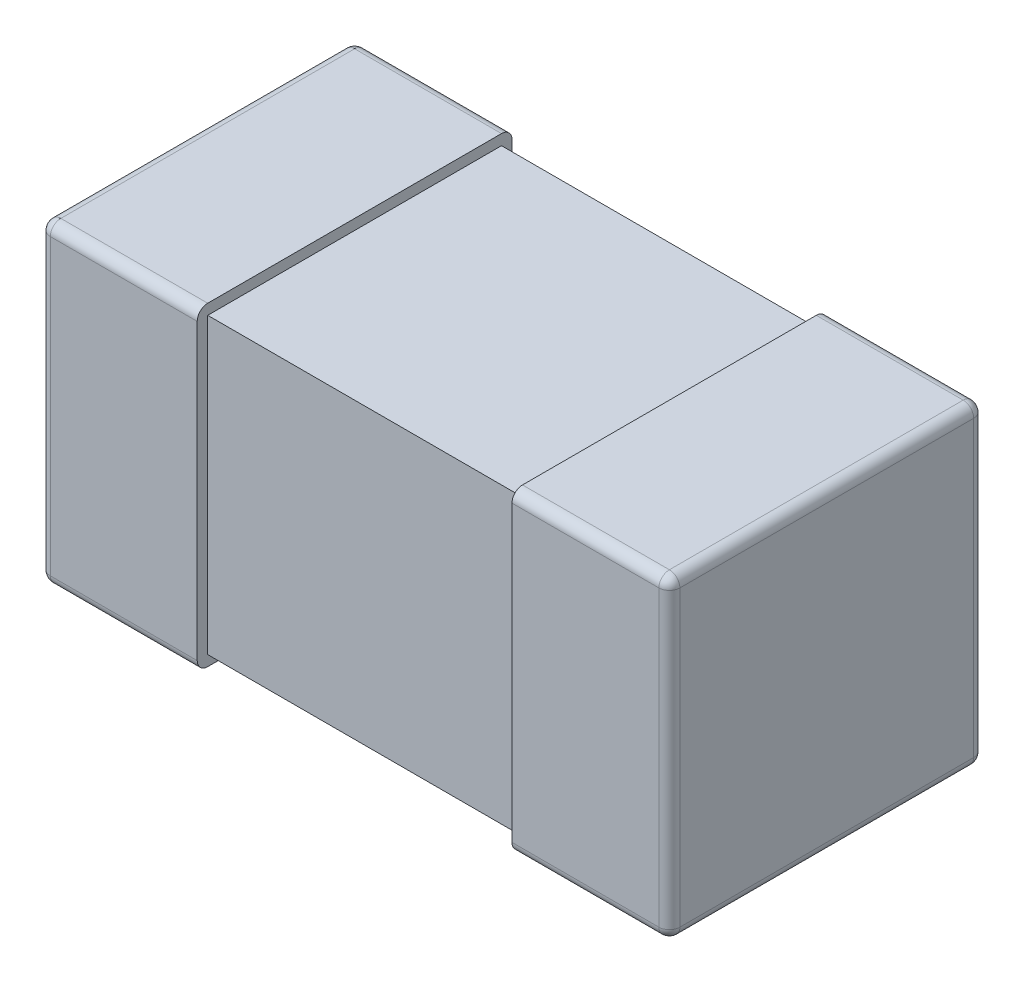
ISO-10303-21;
HEADER;
FILE_DESCRIPTION(('STEP AP214'),'2;1');
FILE_NAME('part.step','',(''),(''),'','','');
FILE_SCHEMA(('AUTOMOTIVE_DESIGN { 1 0 10303 214 1 1 1 1 }'));
ENDSEC;
DATA;
#1=APPLICATION_CONTEXT('core data for automotive mechanical design processes');
#2=APPLICATION_PROTOCOL_DEFINITION('international standard','automotive_design',2000,#1);
#3=PRODUCT_CONTEXT('',#1,'mechanical');
#4=PRODUCT('Part','Part','',(#3));
#5=PRODUCT_RELATED_PRODUCT_CATEGORY('part','',(#4));
#6=PRODUCT_DEFINITION_FORMATION('','',#4);
#7=PRODUCT_DEFINITION_CONTEXT('part definition',#1,'design');
#8=PRODUCT_DEFINITION('design','',#6,#7);
#9=PRODUCT_DEFINITION_SHAPE('','',#8);
#10=(LENGTH_UNIT() NAMED_UNIT(*) SI_UNIT(.MILLI.,.METRE.));
#11=(NAMED_UNIT(*) PLANE_ANGLE_UNIT() SI_UNIT($,.RADIAN.));
#12=(NAMED_UNIT(*) SI_UNIT($,.STERADIAN.) SOLID_ANGLE_UNIT());
#13=UNCERTAINTY_MEASURE_WITH_UNIT(LENGTH_MEASURE(1.E-05),#10,'distance_accuracy_value','');
#14=(GEOMETRIC_REPRESENTATION_CONTEXT(3) GLOBAL_UNCERTAINTY_ASSIGNED_CONTEXT((#13)) GLOBAL_UNIT_ASSIGNED_CONTEXT((#10,
#11,#12)) REPRESENTATION_CONTEXT('',''));
#15=CARTESIAN_POINT('',(0.,0.,0.));
#16=DIRECTION('',(0.,0.,1.));
#17=DIRECTION('',(1.,0.,0.));
#18=AXIS2_PLACEMENT_3D('',#15,#16,#17);
#19=CARTESIAN_POINT('',(-0.3,0.15,-0.15));
#20=DIRECTION('',(1.,0.,0.));
#21=DIRECTION('',(0.,1.,0.));
#22=AXIS2_PLACEMENT_3D('',#19,#20,#21);
#23=PLANE('',#22);
#24=DIRECTION('',(0.,-1.,0.));
#25=VECTOR('',#24,1.);
#26=CARTESIAN_POINT('',(-0.3,0.15,-0.14));
#27=LINE('',#26,#25);
#28=CARTESIAN_POINT('',(-0.3,0.14,-0.14));
#29=VERTEX_POINT('',#28);
#30=CARTESIAN_POINT('',(-0.3,-0.14,-0.14));
#31=VERTEX_POINT('',#30);
#32=EDGE_CURVE('E11',#29,#31,#27,.T.);
#33=ORIENTED_EDGE('',*,*,#32,.T.);
#34=DIRECTION('',(0.,0.,1.));
#35=VECTOR('',#34,1.);
#36=CARTESIAN_POINT('',(-0.3,-0.14,-0.15));
#37=LINE('',#36,#35);
#38=CARTESIAN_POINT('',(-0.3,-0.14,0.14));
#39=VERTEX_POINT('',#38);
#40=EDGE_CURVE('E29',#31,#39,#37,.T.);
#41=ORIENTED_EDGE('',*,*,#40,.T.);
#42=DIRECTION('',(0.,1.,0.));
#43=VECTOR('',#42,1.);
#44=CARTESIAN_POINT('',(-0.3,0.15,0.14));
#45=LINE('',#44,#43);
#46=CARTESIAN_POINT('',(-0.3,0.14,0.14));
#47=VERTEX_POINT('',#46);
#48=EDGE_CURVE('E253',#39,#47,#45,.T.);
#49=ORIENTED_EDGE('',*,*,#48,.T.);
#50=DIRECTION('',(0.,0.,-1.));
#51=VECTOR('',#50,1.);
#52=CARTESIAN_POINT('',(-0.3,0.14,-0.15));
#53=LINE('',#52,#51);
#54=EDGE_CURVE('E246',#47,#29,#53,.T.);
#55=ORIENTED_EDGE('',*,*,#54,.T.);
#56=EDGE_LOOP('',(#33,#41,#49,#55));
#57=FACE_BOUND('',#56,.T.);
#58=ADVANCED_FACE('F18',(#57),#23,.F.);
#59=CARTESIAN_POINT('',(-0.3,0.15,0.15));
#60=DIRECTION('',(0.,0.,-1.));
#61=DIRECTION('',(0.,-1.,0.));
#62=AXIS2_PLACEMENT_3D('',#59,#60,#61);
#63=PLANE('',#62);
#64=DIRECTION('',(0.,-1.,0.));
#65=VECTOR('',#64,1.);
#66=CARTESIAN_POINT('',(-0.29,0.15,0.15));
#67=LINE('',#66,#65);
#68=CARTESIAN_POINT('',(-0.29,0.14,0.15));
#69=VERTEX_POINT('',#68);
#70=CARTESIAN_POINT('',(-0.29,-0.14,0.15));
#71=VERTEX_POINT('',#70);
#72=EDGE_CURVE('E254',#69,#71,#67,.T.);
#73=ORIENTED_EDGE('',*,*,#72,.T.);
#74=DIRECTION('',(1.,0.,0.));
#75=VECTOR('',#74,1.);
#76=CARTESIAN_POINT('',(-0.3,-0.14,0.15));
#77=LINE('',#76,#75);
#78=CARTESIAN_POINT('',(-0.15,-0.14,0.15));
#79=VERTEX_POINT('',#78);
#80=EDGE_CURVE('E317',#71,#79,#77,.T.);
#81=ORIENTED_EDGE('',*,*,#80,.T.);
#82=DIRECTION('',(0.,-1.,0.));
#83=VECTOR('',#82,1.);
#84=CARTESIAN_POINT('',(-0.15,0.15,0.15));
#85=LINE('',#84,#83);
#86=CARTESIAN_POINT('',(-0.15,0.14,0.15));
#87=VERTEX_POINT('',#86);
#88=EDGE_CURVE('E308',#87,#79,#85,.T.);
#89=ORIENTED_EDGE('',*,*,#88,.F.);
#90=DIRECTION('',(-1.,0.,0.));
#91=VECTOR('',#90,1.);
#92=CARTESIAN_POINT('',(-0.3,0.14,0.15));
#93=LINE('',#92,#91);
#94=EDGE_CURVE('E321',#87,#69,#93,.T.);
#95=ORIENTED_EDGE('',*,*,#94,.T.);
#96=EDGE_LOOP('',(#73,#81,#89,#95));
#97=FACE_BOUND('',#96,.T.);
#98=ADVANCED_FACE('F922',(#97),#63,.F.);
#99=CARTESIAN_POINT('',(-0.15,0.15,-0.15));
#100=DIRECTION('',(-1.,0.,0.));
#101=DIRECTION('',(0.,0.,1.));
#102=AXIS2_PLACEMENT_3D('',#99,#100,#101);
#103=PLANE('',#102);
#104=DIRECTION('',(0.,0.,-1.));
#105=VECTOR('',#104,1.);
#106=CARTESIAN_POINT('',(-0.15,-0.15,-0.15));
#107=LINE('',#106,#105);
#108=CARTESIAN_POINT('',(-0.15,-0.15,0.14));
#109=VERTEX_POINT('',#108);
#110=CARTESIAN_POINT('',(-0.15,-0.15,-0.14));
#111=VERTEX_POINT('',#110);
#112=EDGE_CURVE('E363',#109,#111,#107,.T.);
#113=ORIENTED_EDGE('',*,*,#112,.T.);
#114=CARTESIAN_POINT('',(-0.15,-0.14,-0.14));
#115=DIRECTION('',(1.,0.,0.));
#116=DIRECTION('',(0.,0.,1.));
#117=AXIS2_PLACEMENT_3D('',#114,#115,#116);
#118=CIRCLE('',#117,0.01);
#119=CARTESIAN_POINT('',(-0.15,-0.14,-0.15));
#120=VERTEX_POINT('',#119);
#121=EDGE_CURVE('E399',#111,#120,#118,.T.);
#122=ORIENTED_EDGE('',*,*,#121,.T.);
#123=DIRECTION('',(0.,-1.,0.));
#124=VECTOR('',#123,1.);
#125=CARTESIAN_POINT('',(-0.15,0.15,-0.15));
#126=LINE('',#125,#124);
#127=CARTESIAN_POINT('',(-0.15,0.14,-0.15));
#128=VERTEX_POINT('',#127);
#129=EDGE_CURVE('E22',#128,#120,#126,.T.);
#130=ORIENTED_EDGE('',*,*,#129,.F.);
#131=CARTESIAN_POINT('',(-0.15,0.14,-0.14));
#132=DIRECTION('',(1.,0.,0.));
#133=DIRECTION('',(0.,0.,1.));
#134=AXIS2_PLACEMENT_3D('',#131,#132,#133);
#135=CIRCLE('',#134,0.01);
#136=CARTESIAN_POINT('',(-0.15,0.15,-0.14));
#137=VERTEX_POINT('',#136);
#138=EDGE_CURVE('E451',#128,#137,#135,.T.);
#139=ORIENTED_EDGE('',*,*,#138,.T.);
#140=DIRECTION('',(0.,0.,-1.));
#141=VECTOR('',#140,1.);
#142=CARTESIAN_POINT('',(-0.15,0.15,-0.15));
#143=LINE('',#142,#141);
#144=CARTESIAN_POINT('',(-0.15,0.15,0.14));
#145=VERTEX_POINT('',#144);
#146=EDGE_CURVE('E115',#145,#137,#143,.T.);
#147=ORIENTED_EDGE('',*,*,#146,.F.);
#148=CARTESIAN_POINT('',(-0.15,0.14,0.14));
#149=DIRECTION('',(1.,0.,0.));
#150=DIRECTION('',(0.,0.,1.));
#151=AXIS2_PLACEMENT_3D('',#148,#149,#150);
#152=CIRCLE('',#151,0.01);
#153=EDGE_CURVE('E471',#145,#87,#152,.T.);
#154=ORIENTED_EDGE('',*,*,#153,.T.);
#155=ORIENTED_EDGE('',*,*,#88,.T.);
#156=CARTESIAN_POINT('',(-0.15,-0.14,0.14));
#157=DIRECTION('',(1.,0.,0.));
#158=DIRECTION('',(0.,0.,1.));
#159=AXIS2_PLACEMENT_3D('',#156,#157,#158);
#160=CIRCLE('',#159,0.01);
#161=EDGE_CURVE('E127',#79,#109,#160,.T.);
#162=ORIENTED_EDGE('',*,*,#161,.T.);
#163=EDGE_LOOP('',(#113,#122,#130,#139,#147,#154,#155,#162));
#164=FACE_BOUND('',#163,.T.);
#165=DIRECTION('',(0.,1.,0.));
#166=VECTOR('',#165,1.);
#167=CARTESIAN_POINT('',(-0.15,0.14,-0.14));
#168=LINE('',#167,#166);
#169=CARTESIAN_POINT('',(-0.15,-0.14,-0.14));
#170=VERTEX_POINT('',#169);
#171=CARTESIAN_POINT('',(-0.15,0.14,-0.14));
#172=VERTEX_POINT('',#171);
#173=EDGE_CURVE('E456',#170,#172,#168,.T.);
#174=ORIENTED_EDGE('',*,*,#173,.F.);
#175=DIRECTION('',(0.,0.,-1.));
#176=VECTOR('',#175,1.);
#177=CARTESIAN_POINT('',(-0.15,-0.14,0.14));
#178=LINE('',#177,#176);
#179=CARTESIAN_POINT('',(-0.15,-0.14,0.14));
#180=VERTEX_POINT('',#179);
#181=EDGE_CURVE('E432',#180,#170,#178,.T.);
#182=ORIENTED_EDGE('',*,*,#181,.F.);
#183=DIRECTION('',(0.,-1.,0.));
#184=VECTOR('',#183,1.);
#185=CARTESIAN_POINT('',(-0.15,0.14,0.14));
#186=LINE('',#185,#184);
#187=CARTESIAN_POINT('',(-0.15,0.14,0.14));
#188=VERTEX_POINT('',#187);
#189=EDGE_CURVE('E375',#188,#180,#186,.T.);
#190=ORIENTED_EDGE('',*,*,#189,.F.);
#191=DIRECTION('',(0.,0.,1.));
#192=VECTOR('',#191,1.);
#193=CARTESIAN_POINT('',(-0.15,0.14,0.14));
#194=LINE('',#193,#192);
#195=EDGE_CURVE('E457',#172,#188,#194,.T.);
#196=ORIENTED_EDGE('',*,*,#195,.F.);
#197=EDGE_LOOP('',(#174,#182,#190,#196));
#198=FACE_BOUND('',#197,.T.);
#199=ADVANCED_FACE('F916',(#164,#198),#103,.F.);
#200=CARTESIAN_POINT('',(-0.3,0.15,-0.15));
#201=DIRECTION('',(0.,0.,1.));
#202=DIRECTION('',(1.,0.,0.));
#203=AXIS2_PLACEMENT_3D('',#200,#201,#202);
#204=PLANE('',#203);
#205=ORIENTED_EDGE('',*,*,#129,.T.);
#206=DIRECTION('',(-1.,0.,0.));
#207=VECTOR('',#206,1.);
#208=CARTESIAN_POINT('',(-0.3,-0.14,-0.15));
#209=LINE('',#208,#207);
#210=CARTESIAN_POINT('',(-0.29,-0.14,-0.15));
#211=VERTEX_POINT('',#210);
#212=EDGE_CURVE('E346',#120,#211,#209,.T.);
#213=ORIENTED_EDGE('',*,*,#212,.T.);
#214=DIRECTION('',(0.,1.,0.));
#215=VECTOR('',#214,1.);
#216=CARTESIAN_POINT('',(-0.29,0.15,-0.15));
#217=LINE('',#216,#215);
#218=CARTESIAN_POINT('',(-0.29,0.14,-0.15));
#219=VERTEX_POINT('',#218);
#220=EDGE_CURVE('E350',#211,#219,#217,.T.);
#221=ORIENTED_EDGE('',*,*,#220,.T.);
#222=DIRECTION('',(1.,0.,0.));
#223=VECTOR('',#222,1.);
#224=CARTESIAN_POINT('',(-0.15,0.14,-0.15));
#225=LINE('',#224,#223);
#226=EDGE_CURVE('E373',#219,#128,#225,.T.);
#227=ORIENTED_EDGE('',*,*,#226,.T.);
#228=EDGE_LOOP('',(#205,#213,#221,#227));
#229=FACE_BOUND('',#228,.T.);
#230=ADVANCED_FACE('F921',(#229),#204,.F.);
#231=CARTESIAN_POINT('',(-0.3,0.15,0.15));
#232=DIRECTION('',(0.,1.,0.));
#233=DIRECTION('',(1.,0.,0.));
#234=AXIS2_PLACEMENT_3D('',#231,#232,#233);
#235=PLANE('',#234);
#236=ORIENTED_EDGE('',*,*,#146,.T.);
#237=DIRECTION('',(-1.,0.,0.));
#238=VECTOR('',#237,1.);
#239=CARTESIAN_POINT('',(-0.3,0.15,-0.14));
#240=LINE('',#239,#238);
#241=CARTESIAN_POINT('',(-0.29,0.15,-0.14));
#242=VERTEX_POINT('',#241);
#243=EDGE_CURVE('E374',#137,#242,#240,.T.);
#244=ORIENTED_EDGE('',*,*,#243,.T.);
#245=DIRECTION('',(0.,0.,1.));
#246=VECTOR('',#245,1.);
#247=CARTESIAN_POINT('',(-0.29,0.15,0.15));
#248=LINE('',#247,#246);
#249=CARTESIAN_POINT('',(-0.29,0.15,0.14));
#250=VERTEX_POINT('',#249);
#251=EDGE_CURVE('E337',#242,#250,#248,.T.);
#252=ORIENTED_EDGE('',*,*,#251,.T.);
#253=DIRECTION('',(1.,0.,0.));
#254=VECTOR('',#253,1.);
#255=CARTESIAN_POINT('',(-0.15,0.15,0.14));
#256=LINE('',#255,#254);
#257=EDGE_CURVE('E333',#250,#145,#256,.T.);
#258=ORIENTED_EDGE('',*,*,#257,.T.);
#259=EDGE_LOOP('',(#236,#244,#252,#258));
#260=FACE_BOUND('',#259,.T.);
#261=ADVANCED_FACE('F1003',(#260),#235,.T.);
#262=CARTESIAN_POINT('',(-0.3,-0.15,0.15));
#263=DIRECTION('',(0.,1.,0.));
#264=DIRECTION('',(1.,0.,0.));
#265=AXIS2_PLACEMENT_3D('',#262,#263,#264);
#266=PLANE('',#265);
#267=DIRECTION('',(0.,0.,-1.));
#268=VECTOR('',#267,1.);
#269=CARTESIAN_POINT('',(-0.29,-0.15,0.15));
#270=LINE('',#269,#268);
#271=CARTESIAN_POINT('',(-0.29,-0.15,0.14));
#272=VERTEX_POINT('',#271);
#273=CARTESIAN_POINT('',(-0.29,-0.15,-0.14));
#274=VERTEX_POINT('',#273);
#275=EDGE_CURVE('E338',#272,#274,#270,.T.);
#276=ORIENTED_EDGE('',*,*,#275,.T.);
#277=DIRECTION('',(1.,0.,0.));
#278=VECTOR('',#277,1.);
#279=CARTESIAN_POINT('',(-0.3,-0.15,-0.14));
#280=LINE('',#279,#278);
#281=EDGE_CURVE('E447',#274,#111,#280,.T.);
#282=ORIENTED_EDGE('',*,*,#281,.T.);
#283=ORIENTED_EDGE('',*,*,#112,.F.);
#284=DIRECTION('',(-1.,0.,0.));
#285=VECTOR('',#284,1.);
#286=CARTESIAN_POINT('',(-0.3,-0.15,0.14));
#287=LINE('',#286,#285);
#288=EDGE_CURVE('E385',#109,#272,#287,.T.);
#289=ORIENTED_EDGE('',*,*,#288,.T.);
#290=EDGE_LOOP('',(#276,#282,#283,#289));
#291=FACE_BOUND('',#290,.T.);
#292=ADVANCED_FACE('F998',(#291),#266,.F.);
#293=CARTESIAN_POINT('',(-0.3,0.14,-0.14));
#294=DIRECTION('',(1.,0.,0.));
#295=DIRECTION('',(0.,0.,-1.));
#296=AXIS2_PLACEMENT_3D('',#293,#294,#295);
#297=CYLINDRICAL_SURFACE('',#296,0.01);
#298=ORIENTED_EDGE('',*,*,#138,.F.);
#299=ORIENTED_EDGE('',*,*,#226,.F.);
#300=CARTESIAN_POINT('',(-0.29,0.14,-0.14));
#301=DIRECTION('',(-1.,0.,0.));
#302=DIRECTION('',(0.,0.,1.));
#303=AXIS2_PLACEMENT_3D('',#300,#301,#302);
#304=CIRCLE('',#303,0.01);
#305=EDGE_CURVE('E386',#242,#219,#304,.T.);
#306=ORIENTED_EDGE('',*,*,#305,.F.);
#307=ORIENTED_EDGE('',*,*,#243,.F.);
#308=EDGE_LOOP('',(#298,#299,#306,#307));
#309=FACE_BOUND('',#308,.T.);
#310=ADVANCED_FACE('F20',(#309),#297,.T.);
#311=CARTESIAN_POINT('',(-0.29,0.14,0.15));
#312=DIRECTION('',(0.,0.,-1.));
#313=DIRECTION('',(-1.,0.,0.));
#314=AXIS2_PLACEMENT_3D('',#311,#312,#313);
#315=CYLINDRICAL_SURFACE('',#314,0.01);
#316=CARTESIAN_POINT('',(-0.29,0.14,0.14));
#317=DIRECTION('',(0.,0.,1.));
#318=DIRECTION('',(1.,0.,0.));
#319=AXIS2_PLACEMENT_3D('',#316,#317,#318);
#320=CIRCLE('',#319,0.01);
#321=EDGE_CURVE('E232',#250,#47,#320,.T.);
#322=ORIENTED_EDGE('',*,*,#321,.F.);
#323=ORIENTED_EDGE('',*,*,#251,.F.);
#324=CARTESIAN_POINT('',(-0.29,0.14,-0.14));
#325=DIRECTION('',(0.,0.,-1.));
#326=DIRECTION('',(0.,1.,0.));
#327=AXIS2_PLACEMENT_3D('',#324,#325,#326);
#328=CIRCLE('',#327,0.01);
#329=EDGE_CURVE('E250',#29,#242,#328,.T.);
#330=ORIENTED_EDGE('',*,*,#329,.F.);
#331=ORIENTED_EDGE('',*,*,#54,.F.);
#332=EDGE_LOOP('',(#322,#323,#330,#331));
#333=FACE_BOUND('',#332,.T.);
#334=ADVANCED_FACE('F248',(#333),#315,.T.);
#335=CARTESIAN_POINT('',(-0.3,0.14,0.14));
#336=DIRECTION('',(-1.,0.,0.));
#337=DIRECTION('',(0.,0.,1.));
#338=AXIS2_PLACEMENT_3D('',#335,#336,#337);
#339=CYLINDRICAL_SURFACE('',#338,0.01);
#340=ORIENTED_EDGE('',*,*,#153,.F.);
#341=ORIENTED_EDGE('',*,*,#257,.F.);
#342=CARTESIAN_POINT('',(-0.29,0.14,0.14));
#343=DIRECTION('',(-1.,0.,0.));
#344=DIRECTION('',(0.,0.,1.));
#345=AXIS2_PLACEMENT_3D('',#342,#343,#344);
#346=CIRCLE('',#345,0.01);
#347=EDGE_CURVE('E238',#69,#250,#346,.T.);
#348=ORIENTED_EDGE('',*,*,#347,.F.);
#349=ORIENTED_EDGE('',*,*,#94,.F.);
#350=EDGE_LOOP('',(#340,#341,#348,#349));
#351=FACE_BOUND('',#350,.T.);
#352=ADVANCED_FACE('F1053',(#351),#339,.T.);
#353=CARTESIAN_POINT('',(-0.29,0.14,-0.14));
#354=DIRECTION('',(0.,1.,0.));
#355=DIRECTION('',(1.,0.,0.));
#356=AXIS2_PLACEMENT_3D('',#353,#354,#355);
#357=SPHERICAL_SURFACE('',#356,0.01);
#358=ORIENTED_EDGE('',*,*,#329,.T.);
#359=ORIENTED_EDGE('',*,*,#305,.T.);
#360=CARTESIAN_POINT('',(-0.29,0.14,-0.14));
#361=DIRECTION('',(0.,-1.,0.));
#362=DIRECTION('',(0.,0.,1.));
#363=AXIS2_PLACEMENT_3D('',#360,#361,#362);
#364=CIRCLE('',#363,0.01);
#365=EDGE_CURVE('E243',#29,#219,#364,.T.);
#366=ORIENTED_EDGE('',*,*,#365,.F.);
#367=EDGE_LOOP('',(#358,#359,#366));
#368=FACE_BOUND('',#367,.T.);
#369=ADVANCED_FACE('F852',(#368),#357,.T.);
#370=CARTESIAN_POINT('',(-0.29,0.14,0.14));
#371=DIRECTION('',(0.,1.,0.));
#372=DIRECTION('',(1.,0.,0.));
#373=AXIS2_PLACEMENT_3D('',#370,#371,#372);
#374=SPHERICAL_SURFACE('',#373,0.01);
#375=ORIENTED_EDGE('',*,*,#347,.T.);
#376=ORIENTED_EDGE('',*,*,#321,.T.);
#377=CARTESIAN_POINT('',(-0.29,0.14,0.14));
#378=DIRECTION('',(0.,-1.,0.));
#379=DIRECTION('',(0.,0.,1.));
#380=AXIS2_PLACEMENT_3D('',#377,#378,#379);
#381=CIRCLE('',#380,0.01);
#382=EDGE_CURVE('E236',#69,#47,#381,.T.);
#383=ORIENTED_EDGE('',*,*,#382,.F.);
#384=EDGE_LOOP('',(#375,#376,#383));
#385=FACE_BOUND('',#384,.T.);
#386=ADVANCED_FACE('F234',(#385),#374,.T.);
#387=CARTESIAN_POINT('',(-0.3,-0.14,-0.14));
#388=DIRECTION('',(-1.,0.,0.));
#389=DIRECTION('',(0.,0.,1.));
#390=AXIS2_PLACEMENT_3D('',#387,#388,#389);
#391=CYLINDRICAL_SURFACE('',#390,0.01);
#392=ORIENTED_EDGE('',*,*,#121,.F.);
#393=ORIENTED_EDGE('',*,*,#281,.F.);
#394=CARTESIAN_POINT('',(-0.29,-0.14,-0.14));
#395=DIRECTION('',(-1.,0.,0.));
#396=DIRECTION('',(0.,0.,1.));
#397=AXIS2_PLACEMENT_3D('',#394,#395,#396);
#398=CIRCLE('',#397,0.01);
#399=EDGE_CURVE('E274',#211,#274,#398,.T.);
#400=ORIENTED_EDGE('',*,*,#399,.F.);
#401=ORIENTED_EDGE('',*,*,#212,.F.);
#402=EDGE_LOOP('',(#392,#393,#400,#401));
#403=FACE_BOUND('',#402,.T.);
#404=ADVANCED_FACE('F851',(#403),#391,.T.);
#405=CARTESIAN_POINT('',(-0.29,0.15,-0.14));
#406=DIRECTION('',(0.,-1.,0.));
#407=DIRECTION('',(0.,0.,-1.));
#408=AXIS2_PLACEMENT_3D('',#405,#406,#407);
#409=CYLINDRICAL_SURFACE('',#408,0.01);
#410=ORIENTED_EDGE('',*,*,#365,.T.);
#411=ORIENTED_EDGE('',*,*,#220,.F.);
#412=CARTESIAN_POINT('',(-0.29,-0.14,-0.14));
#413=DIRECTION('',(0.,-1.,0.));
#414=DIRECTION('',(0.,0.,-1.));
#415=AXIS2_PLACEMENT_3D('',#412,#413,#414);
#416=CIRCLE('',#415,0.01);
#417=EDGE_CURVE('E44',#31,#211,#416,.T.);
#418=ORIENTED_EDGE('',*,*,#417,.F.);
#419=ORIENTED_EDGE('',*,*,#32,.F.);
#420=EDGE_LOOP('',(#410,#411,#418,#419));
#421=FACE_BOUND('',#420,.T.);
#422=ADVANCED_FACE('F864',(#421),#409,.T.);
#423=CARTESIAN_POINT('',(-0.29,0.15,0.14));
#424=DIRECTION('',(0.,-1.,0.));
#425=DIRECTION('',(0.,0.,-1.));
#426=AXIS2_PLACEMENT_3D('',#423,#424,#425);
#427=CYLINDRICAL_SURFACE('',#426,0.01);
#428=ORIENTED_EDGE('',*,*,#382,.T.);
#429=ORIENTED_EDGE('',*,*,#48,.F.);
#430=CARTESIAN_POINT('',(-0.29,-0.14,0.14));
#431=DIRECTION('',(0.,-1.,0.));
#432=DIRECTION('',(0.,0.,-1.));
#433=AXIS2_PLACEMENT_3D('',#430,#431,#432);
#434=CIRCLE('',#433,0.01);
#435=EDGE_CURVE('E436',#71,#39,#434,.T.);
#436=ORIENTED_EDGE('',*,*,#435,.F.);
#437=ORIENTED_EDGE('',*,*,#72,.F.);
#438=EDGE_LOOP('',(#428,#429,#436,#437));
#439=FACE_BOUND('',#438,.T.);
#440=ADVANCED_FACE('F263',(#439),#427,.T.);
#441=CARTESIAN_POINT('',(-0.3,-0.14,0.14));
#442=DIRECTION('',(1.,0.,0.));
#443=DIRECTION('',(0.,0.,-1.));
#444=AXIS2_PLACEMENT_3D('',#441,#442,#443);
#445=CYLINDRICAL_SURFACE('',#444,0.01);
#446=ORIENTED_EDGE('',*,*,#161,.F.);
#447=ORIENTED_EDGE('',*,*,#80,.F.);
#448=CARTESIAN_POINT('',(-0.29,-0.14,0.14));
#449=DIRECTION('',(-1.,0.,0.));
#450=DIRECTION('',(0.,0.,1.));
#451=AXIS2_PLACEMENT_3D('',#448,#449,#450);
#452=CIRCLE('',#451,0.01);
#453=EDGE_CURVE('E311',#272,#71,#452,.T.);
#454=ORIENTED_EDGE('',*,*,#453,.F.);
#455=ORIENTED_EDGE('',*,*,#288,.F.);
#456=EDGE_LOOP('',(#446,#447,#454,#455));
#457=FACE_BOUND('',#456,.T.);
#458=ADVANCED_FACE('F894',(#457),#445,.T.);
#459=CARTESIAN_POINT('',(-0.29,-0.14,-0.14));
#460=DIRECTION('',(0.,1.,0.));
#461=DIRECTION('',(1.,0.,0.));
#462=AXIS2_PLACEMENT_3D('',#459,#460,#461);
#463=SPHERICAL_SURFACE('',#462,0.01);
#464=ORIENTED_EDGE('',*,*,#417,.T.);
#465=ORIENTED_EDGE('',*,*,#399,.T.);
#466=CARTESIAN_POINT('',(-0.29,-0.14,-0.14));
#467=DIRECTION('',(0.,0.,1.));
#468=DIRECTION('',(-1.,0.,0.));
#469=AXIS2_PLACEMENT_3D('',#466,#467,#468);
#470=CIRCLE('',#469,0.01);
#471=EDGE_CURVE('E431',#31,#274,#470,.T.);
#472=ORIENTED_EDGE('',*,*,#471,.F.);
#473=EDGE_LOOP('',(#464,#465,#472));
#474=FACE_BOUND('',#473,.T.);
#475=ADVANCED_FACE('F888',(#474),#463,.T.);
#476=CARTESIAN_POINT('',(-0.29,-0.14,0.14));
#477=DIRECTION('',(0.,1.,0.));
#478=DIRECTION('',(1.,0.,0.));
#479=AXIS2_PLACEMENT_3D('',#476,#477,#478);
#480=SPHERICAL_SURFACE('',#479,0.01);
#481=ORIENTED_EDGE('',*,*,#453,.T.);
#482=ORIENTED_EDGE('',*,*,#435,.T.);
#483=CARTESIAN_POINT('',(-0.29,-0.14,0.14));
#484=DIRECTION('',(0.,0.,-1.));
#485=DIRECTION('',(1.,0.,0.));
#486=AXIS2_PLACEMENT_3D('',#483,#484,#485);
#487=CIRCLE('',#486,0.01);
#488=EDGE_CURVE('E428',#272,#39,#487,.T.);
#489=ORIENTED_EDGE('',*,*,#488,.F.);
#490=EDGE_LOOP('',(#481,#482,#489));
#491=FACE_BOUND('',#490,.T.);
#492=ADVANCED_FACE('F893',(#491),#480,.T.);
#493=CARTESIAN_POINT('',(-0.29,-0.14,-0.15));
#494=DIRECTION('',(0.,0.,1.));
#495=DIRECTION('',(1.,0.,0.));
#496=AXIS2_PLACEMENT_3D('',#493,#494,#495);
#497=CYLINDRICAL_SURFACE('',#496,0.01);
#498=ORIENTED_EDGE('',*,*,#471,.T.);
#499=ORIENTED_EDGE('',*,*,#275,.F.);
#500=ORIENTED_EDGE('',*,*,#488,.T.);
#501=ORIENTED_EDGE('',*,*,#40,.F.);
#502=EDGE_LOOP('',(#498,#499,#500,#501));
#503=FACE_BOUND('',#502,.T.);
#504=ADVANCED_FACE('F931',(#503),#497,.T.);
#505=CARTESIAN_POINT('',(-0.545979797464467,-0.14,0.14));
#506=DIRECTION('',(0.,-1.,0.));
#507=DIRECTION('',(0.,0.,-1.));
#508=AXIS2_PLACEMENT_3D('',#505,#506,#507);
#509=PLANE('',#508);
#510=DIRECTION('',(1.,0.,0.));
#511=VECTOR('',#510,1.);
#512=CARTESIAN_POINT('',(-0.545979797464467,-0.14,0.14));
#513=LINE('',#512,#511);
#514=CARTESIAN_POINT('',(0.15,-0.14,0.14));
#515=VERTEX_POINT('',#514);
#516=EDGE_CURVE('E379',#180,#515,#513,.T.);
#517=ORIENTED_EDGE('',*,*,#516,.F.);
#518=ORIENTED_EDGE('',*,*,#181,.T.);
#519=DIRECTION('',(1.,0.,0.));
#520=VECTOR('',#519,1.);
#521=CARTESIAN_POINT('',(-0.545979797464467,-0.14,-0.14));
#522=LINE('',#521,#520);
#523=CARTESIAN_POINT('',(0.15,-0.14,-0.14));
#524=VERTEX_POINT('',#523);
#525=EDGE_CURVE('E500',#170,#524,#522,.T.);
#526=ORIENTED_EDGE('',*,*,#525,.T.);
#527=DIRECTION('',(0.,0.,-1.));
#528=VECTOR('',#527,1.);
#529=CARTESIAN_POINT('',(0.15,-0.14,0.14));
#530=LINE('',#529,#528);
#531=EDGE_CURVE('E358',#515,#524,#530,.T.);
#532=ORIENTED_EDGE('',*,*,#531,.F.);
#533=EDGE_LOOP('',(#517,#518,#526,#532));
#534=FACE_BOUND('',#533,.T.);
#535=ADVANCED_FACE('F835',(#534),#509,.T.);
#536=CARTESIAN_POINT('',(-0.545979797464467,0.14,-0.14));
#537=DIRECTION('',(0.,0.,-1.));
#538=DIRECTION('',(-1.,0.,0.));
#539=AXIS2_PLACEMENT_3D('',#536,#537,#538);
#540=PLANE('',#539);
#541=ORIENTED_EDGE('',*,*,#525,.F.);
#542=ORIENTED_EDGE('',*,*,#173,.T.);
#543=DIRECTION('',(1.,0.,0.));
#544=VECTOR('',#543,1.);
#545=CARTESIAN_POINT('',(-0.545979797464467,0.14,-0.14));
#546=LINE('',#545,#544);
#547=CARTESIAN_POINT('',(0.15,0.14,-0.14));
#548=VERTEX_POINT('',#547);
#549=EDGE_CURVE('E452',#172,#548,#546,.T.);
#550=ORIENTED_EDGE('',*,*,#549,.T.);
#551=DIRECTION('',(0.,1.,0.));
#552=VECTOR('',#551,1.);
#553=CARTESIAN_POINT('',(0.15,0.14,-0.14));
#554=LINE('',#553,#552);
#555=EDGE_CURVE('E328',#524,#548,#554,.T.);
#556=ORIENTED_EDGE('',*,*,#555,.F.);
#557=EDGE_LOOP('',(#541,#542,#550,#556));
#558=FACE_BOUND('',#557,.T.);
#559=ADVANCED_FACE('F829',(#558),#540,.T.);
#560=CARTESIAN_POINT('',(-0.545979797464467,0.14,0.14));
#561=DIRECTION('',(0.,1.,0.));
#562=DIRECTION('',(0.,0.,-1.));
#563=AXIS2_PLACEMENT_3D('',#560,#561,#562);
#564=PLANE('',#563);
#565=ORIENTED_EDGE('',*,*,#549,.F.);
#566=ORIENTED_EDGE('',*,*,#195,.T.);
#567=DIRECTION('',(1.,0.,0.));
#568=VECTOR('',#567,1.);
#569=CARTESIAN_POINT('',(-0.545979797464467,0.14,0.14));
#570=LINE('',#569,#568);
#571=CARTESIAN_POINT('',(0.15,0.14,0.14));
#572=VERTEX_POINT('',#571);
#573=EDGE_CURVE('E378',#188,#572,#570,.T.);
#574=ORIENTED_EDGE('',*,*,#573,.T.);
#575=DIRECTION('',(0.,0.,1.));
#576=VECTOR('',#575,1.);
#577=CARTESIAN_POINT('',(0.15,0.14,0.14));
#578=LINE('',#577,#576);
#579=EDGE_CURVE('E331',#548,#572,#578,.T.);
#580=ORIENTED_EDGE('',*,*,#579,.F.);
#581=EDGE_LOOP('',(#565,#566,#574,#580));
#582=FACE_BOUND('',#581,.T.);
#583=ADVANCED_FACE('F834',(#582),#564,.T.);
#584=CARTESIAN_POINT('',(-0.545979797464467,0.14,0.14));
#585=DIRECTION('',(0.,0.,1.));
#586=DIRECTION('',(1.,0.,0.));
#587=AXIS2_PLACEMENT_3D('',#584,#585,#586);
#588=PLANE('',#587);
#589=ORIENTED_EDGE('',*,*,#573,.F.);
#590=ORIENTED_EDGE('',*,*,#189,.T.);
#591=ORIENTED_EDGE('',*,*,#516,.T.);
#592=DIRECTION('',(0.,-1.,0.));
#593=VECTOR('',#592,1.);
#594=CARTESIAN_POINT('',(0.15,0.14,0.14));
#595=LINE('',#594,#593);
#596=EDGE_CURVE('E381',#572,#515,#595,.T.);
#597=ORIENTED_EDGE('',*,*,#596,.F.);
#598=EDGE_LOOP('',(#589,#590,#591,#597));
#599=FACE_BOUND('',#598,.T.);
#600=ADVANCED_FACE('F1024',(#599),#588,.T.);
#601=CARTESIAN_POINT('',(0.3,0.15,-0.15));
#602=DIRECTION('',(-1.,0.,0.));
#603=DIRECTION('',(0.,0.,1.));
#604=AXIS2_PLACEMENT_3D('',#601,#602,#603);
#605=PLANE('',#604);
#606=DIRECTION('',(0.,-1.,0.));
#607=VECTOR('',#606,1.);
#608=CARTESIAN_POINT('',(0.3,0.15,-0.14));
#609=LINE('',#608,#607);
#610=CARTESIAN_POINT('',(0.3,0.14,-0.14));
#611=VERTEX_POINT('',#610);
#612=CARTESIAN_POINT('',(0.3,-0.14,-0.14));
#613=VERTEX_POINT('',#612);
#614=EDGE_CURVE('E280',#611,#613,#609,.T.);
#615=ORIENTED_EDGE('',*,*,#614,.F.);
#616=DIRECTION('',(0.,0.,-1.));
#617=VECTOR('',#616,1.);
#618=CARTESIAN_POINT('',(0.3,0.14,-0.15));
#619=LINE('',#618,#617);
#620=CARTESIAN_POINT('',(0.3,0.14,0.14));
#621=VERTEX_POINT('',#620);
#622=EDGE_CURVE('E408',#621,#611,#619,.T.);
#623=ORIENTED_EDGE('',*,*,#622,.F.);
#624=DIRECTION('',(0.,1.,0.));
#625=VECTOR('',#624,1.);
#626=CARTESIAN_POINT('',(0.3,0.15,0.14));
#627=LINE('',#626,#625);
#628=CARTESIAN_POINT('',(0.3,-0.14,0.14));
#629=VERTEX_POINT('',#628);
#630=EDGE_CURVE('E368',#629,#621,#627,.T.);
#631=ORIENTED_EDGE('',*,*,#630,.F.);
#632=DIRECTION('',(0.,0.,1.));
#633=VECTOR('',#632,1.);
#634=CARTESIAN_POINT('',(0.3,-0.14,-0.15));
#635=LINE('',#634,#633);
#636=EDGE_CURVE('E488',#613,#629,#635,.T.);
#637=ORIENTED_EDGE('',*,*,#636,.F.);
#638=EDGE_LOOP('',(#615,#623,#631,#637));
#639=FACE_BOUND('',#638,.T.);
#640=ADVANCED_FACE('F556',(#639),#605,.F.);
#641=CARTESIAN_POINT('',(0.3,0.15,0.15));
#642=DIRECTION('',(0.,0.,-1.));
#643=DIRECTION('',(0.,-1.,0.));
#644=AXIS2_PLACEMENT_3D('',#641,#642,#643);
#645=PLANE('',#644);
#646=DIRECTION('',(0.,-1.,0.));
#647=VECTOR('',#646,1.);
#648=CARTESIAN_POINT('',(0.29,0.15,0.15));
#649=LINE('',#648,#647);
#650=CARTESIAN_POINT('',(0.29,0.14,0.15));
#651=VERTEX_POINT('',#650);
#652=CARTESIAN_POINT('',(0.29,-0.14,0.15));
#653=VERTEX_POINT('',#652);
#654=EDGE_CURVE('E173',#651,#653,#649,.T.);
#655=ORIENTED_EDGE('',*,*,#654,.F.);
#656=DIRECTION('',(1.,0.,0.));
#657=VECTOR('',#656,1.);
#658=CARTESIAN_POINT('',(0.3,0.14,0.15));
#659=LINE('',#658,#657);
#660=CARTESIAN_POINT('',(0.15,0.14,0.15));
#661=VERTEX_POINT('',#660);
#662=EDGE_CURVE('E188',#661,#651,#659,.T.);
#663=ORIENTED_EDGE('',*,*,#662,.F.);
#664=DIRECTION('',(0.,-1.,0.));
#665=VECTOR('',#664,1.);
#666=CARTESIAN_POINT('',(0.15,0.15,0.15));
#667=LINE('',#666,#665);
#668=CARTESIAN_POINT('',(0.15,-0.14,0.15));
#669=VERTEX_POINT('',#668);
#670=EDGE_CURVE('E421',#661,#669,#667,.T.);
#671=ORIENTED_EDGE('',*,*,#670,.T.);
#672=DIRECTION('',(-1.,0.,0.));
#673=VECTOR('',#672,1.);
#674=CARTESIAN_POINT('',(0.3,-0.14,0.15));
#675=LINE('',#674,#673);
#676=EDGE_CURVE('E316',#653,#669,#675,.T.);
#677=ORIENTED_EDGE('',*,*,#676,.F.);
#678=EDGE_LOOP('',(#655,#663,#671,#677));
#679=FACE_BOUND('',#678,.T.);
#680=ADVANCED_FACE('F1073',(#679),#645,.F.);
#681=CARTESIAN_POINT('',(0.15,0.15,-0.15));
#682=DIRECTION('',(1.,0.,0.));
#683=DIRECTION('',(0.,1.,0.));
#684=AXIS2_PLACEMENT_3D('',#681,#682,#683);
#685=PLANE('',#684);
#686=DIRECTION('',(0.,0.,-1.));
#687=VECTOR('',#686,1.);
#688=CARTESIAN_POINT('',(0.15,-0.15,-0.15));
#689=LINE('',#688,#687);
#690=CARTESIAN_POINT('',(0.15,-0.15,0.14));
#691=VERTEX_POINT('',#690);
#692=CARTESIAN_POINT('',(0.15,-0.15,-0.14));
#693=VERTEX_POINT('',#692);
#694=EDGE_CURVE('E354',#691,#693,#689,.T.);
#695=ORIENTED_EDGE('',*,*,#694,.F.);
#696=CARTESIAN_POINT('',(0.15,-0.14,0.14));
#697=DIRECTION('',(1.,0.,0.));
#698=DIRECTION('',(0.,0.,1.));
#699=AXIS2_PLACEMENT_3D('',#696,#697,#698);
#700=CIRCLE('',#699,0.01);
#701=EDGE_CURVE('E467',#669,#691,#700,.T.);
#702=ORIENTED_EDGE('',*,*,#701,.F.);
#703=ORIENTED_EDGE('',*,*,#670,.F.);
#704=CARTESIAN_POINT('',(0.15,0.14,0.14));
#705=DIRECTION('',(1.,0.,0.));
#706=DIRECTION('',(0.,0.,1.));
#707=AXIS2_PLACEMENT_3D('',#704,#705,#706);
#708=CIRCLE('',#707,0.01);
#709=CARTESIAN_POINT('',(0.15,0.15,0.14));
#710=VERTEX_POINT('',#709);
#711=EDGE_CURVE('E296',#710,#661,#708,.T.);
#712=ORIENTED_EDGE('',*,*,#711,.F.);
#713=DIRECTION('',(0.,0.,-1.));
#714=VECTOR('',#713,1.);
#715=CARTESIAN_POINT('',(0.15,0.15,-0.15));
#716=LINE('',#715,#714);
#717=CARTESIAN_POINT('',(0.15,0.15,-0.14));
#718=VERTEX_POINT('',#717);
#719=EDGE_CURVE('E417',#710,#718,#716,.T.);
#720=ORIENTED_EDGE('',*,*,#719,.T.);
#721=CARTESIAN_POINT('',(0.15,0.14,-0.14));
#722=DIRECTION('',(1.,0.,0.));
#723=DIRECTION('',(0.,0.,1.));
#724=AXIS2_PLACEMENT_3D('',#721,#722,#723);
#725=CIRCLE('',#724,0.01);
#726=CARTESIAN_POINT('',(0.15,0.14,-0.15));
#727=VERTEX_POINT('',#726);
#728=EDGE_CURVE('E359',#727,#718,#725,.T.);
#729=ORIENTED_EDGE('',*,*,#728,.F.);
#730=DIRECTION('',(0.,-1.,0.));
#731=VECTOR('',#730,1.);
#732=CARTESIAN_POINT('',(0.15,0.15,-0.15));
#733=LINE('',#732,#731);
#734=CARTESIAN_POINT('',(0.15,-0.14,-0.15));
#735=VERTEX_POINT('',#734);
#736=EDGE_CURVE('E330',#727,#735,#733,.T.);
#737=ORIENTED_EDGE('',*,*,#736,.T.);
#738=CARTESIAN_POINT('',(0.15,-0.14,-0.14));
#739=DIRECTION('',(1.,0.,0.));
#740=DIRECTION('',(0.,0.,1.));
#741=AXIS2_PLACEMENT_3D('',#738,#739,#740);
#742=CIRCLE('',#741,0.01);
#743=EDGE_CURVE('E305',#693,#735,#742,.T.);
#744=ORIENTED_EDGE('',*,*,#743,.F.);
#745=EDGE_LOOP('',(#695,#702,#703,#712,#720,#729,#737,#744));
#746=FACE_BOUND('',#745,.T.);
#747=ORIENTED_EDGE('',*,*,#555,.T.);
#748=ORIENTED_EDGE('',*,*,#579,.T.);
#749=ORIENTED_EDGE('',*,*,#596,.T.);
#750=ORIENTED_EDGE('',*,*,#531,.T.);
#751=EDGE_LOOP('',(#747,#748,#749,#750));
#752=FACE_BOUND('',#751,.T.);
#753=ADVANCED_FACE('F946',(#746,#752),#685,.F.);
#754=CARTESIAN_POINT('',(0.3,0.15,-0.15));
#755=DIRECTION('',(0.,0.,1.));
#756=DIRECTION('',(1.,0.,0.));
#757=AXIS2_PLACEMENT_3D('',#754,#755,#756);
#758=PLANE('',#757);
#759=ORIENTED_EDGE('',*,*,#736,.F.);
#760=DIRECTION('',(-1.,0.,0.));
#761=VECTOR('',#760,1.);
#762=CARTESIAN_POINT('',(0.15,0.14,-0.15));
#763=LINE('',#762,#761);
#764=CARTESIAN_POINT('',(0.29,0.14,-0.15));
#765=VERTEX_POINT('',#764);
#766=EDGE_CURVE('E407',#765,#727,#763,.T.);
#767=ORIENTED_EDGE('',*,*,#766,.F.);
#768=DIRECTION('',(0.,1.,0.));
#769=VECTOR('',#768,1.);
#770=CARTESIAN_POINT('',(0.29,0.15,-0.15));
#771=LINE('',#770,#769);
#772=CARTESIAN_POINT('',(0.29,-0.14,-0.15));
#773=VERTEX_POINT('',#772);
#774=EDGE_CURVE('E325',#773,#765,#771,.T.);
#775=ORIENTED_EDGE('',*,*,#774,.F.);
#776=DIRECTION('',(1.,0.,0.));
#777=VECTOR('',#776,1.);
#778=CARTESIAN_POINT('',(0.3,-0.14,-0.15));
#779=LINE('',#778,#777);
#780=EDGE_CURVE('E324',#735,#773,#779,.T.);
#781=ORIENTED_EDGE('',*,*,#780,.F.);
#782=EDGE_LOOP('',(#759,#767,#775,#781));
#783=FACE_BOUND('',#782,.T.);
#784=ADVANCED_FACE('F878',(#783),#758,.F.);
#785=CARTESIAN_POINT('',(0.3,0.15,0.15));
#786=DIRECTION('',(0.,1.,0.));
#787=DIRECTION('',(1.,0.,0.));
#788=AXIS2_PLACEMENT_3D('',#785,#786,#787);
#789=PLANE('',#788);
#790=ORIENTED_EDGE('',*,*,#719,.F.);
#791=DIRECTION('',(-1.,0.,0.));
#792=VECTOR('',#791,1.);
#793=CARTESIAN_POINT('',(0.15,0.15,0.14));
#794=LINE('',#793,#792);
#795=CARTESIAN_POINT('',(0.29,0.15,0.14));
#796=VERTEX_POINT('',#795);
#797=EDGE_CURVE('E290',#796,#710,#794,.T.);
#798=ORIENTED_EDGE('',*,*,#797,.F.);
#799=DIRECTION('',(0.,0.,1.));
#800=VECTOR('',#799,1.);
#801=CARTESIAN_POINT('',(0.29,0.15,0.15));
#802=LINE('',#801,#800);
#803=CARTESIAN_POINT('',(0.29,0.15,-0.14));
#804=VERTEX_POINT('',#803);
#805=EDGE_CURVE('E291',#804,#796,#802,.T.);
#806=ORIENTED_EDGE('',*,*,#805,.F.);
#807=DIRECTION('',(1.,0.,0.));
#808=VECTOR('',#807,1.);
#809=CARTESIAN_POINT('',(0.3,0.15,-0.14));
#810=LINE('',#809,#808);
#811=EDGE_CURVE('E427',#718,#804,#810,.T.);
#812=ORIENTED_EDGE('',*,*,#811,.F.);
#813=EDGE_LOOP('',(#790,#798,#806,#812));
#814=FACE_BOUND('',#813,.T.);
#815=ADVANCED_FACE('F873',(#814),#789,.T.);
#816=CARTESIAN_POINT('',(0.3,-0.15,0.15));
#817=DIRECTION('',(0.,1.,0.));
#818=DIRECTION('',(1.,0.,0.));
#819=AXIS2_PLACEMENT_3D('',#816,#817,#818);
#820=PLANE('',#819);
#821=DIRECTION('',(0.,0.,-1.));
#822=VECTOR('',#821,1.);
#823=CARTESIAN_POINT('',(0.29,-0.15,0.15));
#824=LINE('',#823,#822);
#825=CARTESIAN_POINT('',(0.29,-0.15,0.14));
#826=VERTEX_POINT('',#825);
#827=CARTESIAN_POINT('',(0.29,-0.15,-0.14));
#828=VERTEX_POINT('',#827);
#829=EDGE_CURVE('E484',#826,#828,#824,.T.);
#830=ORIENTED_EDGE('',*,*,#829,.F.);
#831=DIRECTION('',(1.,0.,0.));
#832=VECTOR('',#831,1.);
#833=CARTESIAN_POINT('',(0.3,-0.15,0.14));
#834=LINE('',#833,#832);
#835=EDGE_CURVE('E278',#691,#826,#834,.T.);
#836=ORIENTED_EDGE('',*,*,#835,.F.);
#837=ORIENTED_EDGE('',*,*,#694,.T.);
#838=DIRECTION('',(-1.,0.,0.));
#839=VECTOR('',#838,1.);
#840=CARTESIAN_POINT('',(0.3,-0.15,-0.14));
#841=LINE('',#840,#839);
#842=EDGE_CURVE('E284',#828,#693,#841,.T.);
#843=ORIENTED_EDGE('',*,*,#842,.F.);
#844=EDGE_LOOP('',(#830,#836,#837,#843));
#845=FACE_BOUND('',#844,.T.);
#846=ADVANCED_FACE('F542',(#845),#820,.F.);
#847=CARTESIAN_POINT('',(0.3,0.14,-0.14));
#848=DIRECTION('',(-1.,0.,0.));
#849=DIRECTION('',(0.,0.,-1.));
#850=AXIS2_PLACEMENT_3D('',#847,#848,#849);
#851=CYLINDRICAL_SURFACE('',#850,0.01);
#852=ORIENTED_EDGE('',*,*,#728,.T.);
#853=ORIENTED_EDGE('',*,*,#811,.T.);
#854=CARTESIAN_POINT('',(0.29,0.14,-0.14));
#855=DIRECTION('',(-1.,0.,0.));
#856=DIRECTION('',(0.,0.,1.));
#857=AXIS2_PLACEMENT_3D('',#854,#855,#856);
#858=CIRCLE('',#857,0.01);
#859=EDGE_CURVE('E461',#804,#765,#858,.T.);
#860=ORIENTED_EDGE('',*,*,#859,.T.);
#861=ORIENTED_EDGE('',*,*,#766,.T.);
#862=EDGE_LOOP('',(#852,#853,#860,#861));
#863=FACE_BOUND('',#862,.T.);
#864=ADVANCED_FACE('F967',(#863),#851,.T.);
#865=CARTESIAN_POINT('',(0.29,0.14,0.15));
#866=DIRECTION('',(0.,0.,-1.));
#867=DIRECTION('',(1.,0.,0.));
#868=AXIS2_PLACEMENT_3D('',#865,#866,#867);
#869=CYLINDRICAL_SURFACE('',#868,0.01);
#870=CARTESIAN_POINT('',(0.29,0.14,0.14));
#871=DIRECTION('',(0.,0.,-1.));
#872=DIRECTION('',(-1.,0.,0.));
#873=AXIS2_PLACEMENT_3D('',#870,#871,#872);
#874=CIRCLE('',#873,0.01);
#875=EDGE_CURVE('E403',#796,#621,#874,.T.);
#876=ORIENTED_EDGE('',*,*,#875,.T.);
#877=ORIENTED_EDGE('',*,*,#622,.T.);
#878=CARTESIAN_POINT('',(0.29,0.14,-0.14));
#879=DIRECTION('',(0.,0.,1.));
#880=DIRECTION('',(0.,1.,0.));
#881=AXIS2_PLACEMENT_3D('',#878,#879,#880);
#882=CIRCLE('',#881,0.01);
#883=EDGE_CURVE('E295',#611,#804,#882,.T.);
#884=ORIENTED_EDGE('',*,*,#883,.T.);
#885=ORIENTED_EDGE('',*,*,#805,.T.);
#886=EDGE_LOOP('',(#876,#877,#884,#885));
#887=FACE_BOUND('',#886,.T.);
#888=ADVANCED_FACE('F561',(#887),#869,.T.);
#889=CARTESIAN_POINT('',(0.3,0.14,0.14));
#890=DIRECTION('',(1.,0.,0.));
#891=DIRECTION('',(0.,0.,1.));
#892=AXIS2_PLACEMENT_3D('',#889,#890,#891);
#893=CYLINDRICAL_SURFACE('',#892,0.01);
#894=ORIENTED_EDGE('',*,*,#711,.T.);
#895=ORIENTED_EDGE('',*,*,#662,.T.);
#896=CARTESIAN_POINT('',(0.29,0.14,0.14));
#897=DIRECTION('',(-1.,0.,0.));
#898=DIRECTION('',(0.,0.,1.));
#899=AXIS2_PLACEMENT_3D('',#896,#897,#898);
#900=CIRCLE('',#899,0.01);
#901=EDGE_CURVE('E286',#651,#796,#900,.T.);
#902=ORIENTED_EDGE('',*,*,#901,.T.);
#903=ORIENTED_EDGE('',*,*,#797,.T.);
#904=EDGE_LOOP('',(#894,#895,#902,#903));
#905=FACE_BOUND('',#904,.T.);
#906=ADVANCED_FACE('F1105',(#905),#893,.T.);
#907=CARTESIAN_POINT('',(0.29,0.14,-0.14));
#908=DIRECTION('',(0.,-1.,0.));
#909=DIRECTION('',(-1.,0.,0.));
#910=AXIS2_PLACEMENT_3D('',#907,#908,#909);
#911=SPHERICAL_SURFACE('',#910,0.01);
#912=ORIENTED_EDGE('',*,*,#883,.F.);
#913=CARTESIAN_POINT('',(0.29,0.14,-0.14));
#914=DIRECTION('',(0.,1.,0.));
#915=DIRECTION('',(0.,0.,1.));
#916=AXIS2_PLACEMENT_3D('',#913,#914,#915);
#917=CIRCLE('',#916,0.01);
#918=EDGE_CURVE('E297',#611,#765,#917,.T.);
#919=ORIENTED_EDGE('',*,*,#918,.T.);
#920=ORIENTED_EDGE('',*,*,#859,.F.);
#921=EDGE_LOOP('',(#912,#919,#920));
#922=FACE_BOUND('',#921,.T.);
#923=ADVANCED_FACE('F559',(#922),#911,.T.);
#924=CARTESIAN_POINT('',(0.29,0.14,0.14));
#925=DIRECTION('',(0.,-1.,0.));
#926=DIRECTION('',(-1.,0.,0.));
#927=AXIS2_PLACEMENT_3D('',#924,#925,#926);
#928=SPHERICAL_SURFACE('',#927,0.01);
#929=ORIENTED_EDGE('',*,*,#901,.F.);
#930=CARTESIAN_POINT('',(0.29,0.14,0.14));
#931=DIRECTION('',(0.,1.,0.));
#932=DIRECTION('',(0.,0.,1.));
#933=AXIS2_PLACEMENT_3D('',#930,#931,#932);
#934=CIRCLE('',#933,0.01);
#935=EDGE_CURVE('E300',#651,#621,#934,.T.);
#936=ORIENTED_EDGE('',*,*,#935,.T.);
#937=ORIENTED_EDGE('',*,*,#875,.F.);
#938=EDGE_LOOP('',(#929,#936,#937));
#939=FACE_BOUND('',#938,.T.);
#940=ADVANCED_FACE('F565',(#939),#928,.T.);
#941=CARTESIAN_POINT('',(0.3,-0.14,-0.14));
#942=DIRECTION('',(1.,0.,0.));
#943=DIRECTION('',(0.,0.,1.));
#944=AXIS2_PLACEMENT_3D('',#941,#942,#943);
#945=CYLINDRICAL_SURFACE('',#944,0.01);
#946=ORIENTED_EDGE('',*,*,#743,.T.);
#947=ORIENTED_EDGE('',*,*,#780,.T.);
#948=CARTESIAN_POINT('',(0.29,-0.14,-0.14));
#949=DIRECTION('',(-1.,0.,0.));
#950=DIRECTION('',(0.,0.,1.));
#951=AXIS2_PLACEMENT_3D('',#948,#949,#950);
#952=CIRCLE('',#951,0.01);
#953=EDGE_CURVE('E339',#773,#828,#952,.T.);
#954=ORIENTED_EDGE('',*,*,#953,.T.);
#955=ORIENTED_EDGE('',*,*,#842,.T.);
#956=EDGE_LOOP('',(#946,#947,#954,#955));
#957=FACE_BOUND('',#956,.T.);
#958=ADVANCED_FACE('F545',(#957),#945,.T.);
#959=CARTESIAN_POINT('',(0.29,0.15,-0.14));
#960=DIRECTION('',(0.,-1.,0.));
#961=DIRECTION('',(0.,0.,-1.));
#962=AXIS2_PLACEMENT_3D('',#959,#960,#961);
#963=CYLINDRICAL_SURFACE('',#962,0.01);
#964=ORIENTED_EDGE('',*,*,#918,.F.);
#965=ORIENTED_EDGE('',*,*,#614,.T.);
#966=CARTESIAN_POINT('',(0.29,-0.14,-0.14));
#967=DIRECTION('',(0.,1.,0.));
#968=DIRECTION('',(0.,0.,-1.));
#969=AXIS2_PLACEMENT_3D('',#966,#967,#968);
#970=CIRCLE('',#969,0.01);
#971=EDGE_CURVE('E285',#613,#773,#970,.T.);
#972=ORIENTED_EDGE('',*,*,#971,.T.);
#973=ORIENTED_EDGE('',*,*,#774,.T.);
#974=EDGE_LOOP('',(#964,#965,#972,#973));
#975=FACE_BOUND('',#974,.T.);
#976=ADVANCED_FACE('F551',(#975),#963,.T.);
#977=CARTESIAN_POINT('',(0.29,0.15,0.14));
#978=DIRECTION('',(0.,-1.,0.));
#979=DIRECTION('',(0.,0.,-1.));
#980=AXIS2_PLACEMENT_3D('',#977,#978,#979);
#981=CYLINDRICAL_SURFACE('',#980,0.01);
#982=ORIENTED_EDGE('',*,*,#935,.F.);
#983=ORIENTED_EDGE('',*,*,#654,.T.);
#984=CARTESIAN_POINT('',(0.29,-0.14,0.14));
#985=DIRECTION('',(0.,1.,0.));
#986=DIRECTION('',(0.,0.,-1.));
#987=AXIS2_PLACEMENT_3D('',#984,#985,#986);
#988=CIRCLE('',#987,0.01);
#989=EDGE_CURVE('E364',#653,#629,#988,.T.);
#990=ORIENTED_EDGE('',*,*,#989,.T.);
#991=ORIENTED_EDGE('',*,*,#630,.T.);
#992=EDGE_LOOP('',(#982,#983,#990,#991));
#993=FACE_BOUND('',#992,.T.);
#994=ADVANCED_FACE('F567',(#993),#981,.T.);
#995=CARTESIAN_POINT('',(0.3,-0.14,0.14));
#996=DIRECTION('',(-1.,0.,0.));
#997=DIRECTION('',(0.,0.,-1.));
#998=AXIS2_PLACEMENT_3D('',#995,#996,#997);
#999=CYLINDRICAL_SURFACE('',#998,0.01);
#1000=ORIENTED_EDGE('',*,*,#701,.T.);
#1001=ORIENTED_EDGE('',*,*,#835,.T.);
#1002=CARTESIAN_POINT('',(0.29,-0.14,0.14));
#1003=DIRECTION('',(-1.,0.,0.));
#1004=DIRECTION('',(0.,0.,1.));
#1005=AXIS2_PLACEMENT_3D('',#1002,#1003,#1004);
#1006=CIRCLE('',#1005,0.01);
#1007=EDGE_CURVE('E312',#826,#653,#1006,.T.);
#1008=ORIENTED_EDGE('',*,*,#1007,.T.);
#1009=ORIENTED_EDGE('',*,*,#676,.T.);
#1010=EDGE_LOOP('',(#1000,#1001,#1008,#1009));
#1011=FACE_BOUND('',#1010,.T.);
#1012=ADVANCED_FACE('F573',(#1011),#999,.T.);
#1013=CARTESIAN_POINT('',(0.29,-0.14,-0.14));
#1014=DIRECTION('',(0.,-1.,0.));
#1015=DIRECTION('',(-1.,0.,0.));
#1016=AXIS2_PLACEMENT_3D('',#1013,#1014,#1015);
#1017=SPHERICAL_SURFACE('',#1016,0.01);
#1018=ORIENTED_EDGE('',*,*,#971,.F.);
#1019=CARTESIAN_POINT('',(0.29,-0.14,-0.14));
#1020=DIRECTION('',(0.,0.,-1.));
#1021=DIRECTION('',(1.,0.,0.));
#1022=AXIS2_PLACEMENT_3D('',#1019,#1020,#1021);
#1023=CIRCLE('',#1022,0.01);
#1024=EDGE_CURVE('E393',#613,#828,#1023,.T.);
#1025=ORIENTED_EDGE('',*,*,#1024,.T.);
#1026=ORIENTED_EDGE('',*,*,#953,.F.);
#1027=EDGE_LOOP('',(#1018,#1025,#1026));
#1028=FACE_BOUND('',#1027,.T.);
#1029=ADVANCED_FACE('F532',(#1028),#1017,.T.);
#1030=CARTESIAN_POINT('',(0.29,-0.14,0.14));
#1031=DIRECTION('',(0.,-1.,0.));
#1032=DIRECTION('',(-1.,0.,0.));
#1033=AXIS2_PLACEMENT_3D('',#1030,#1031,#1032);
#1034=SPHERICAL_SURFACE('',#1033,0.01);
#1035=ORIENTED_EDGE('',*,*,#1007,.F.);
#1036=CARTESIAN_POINT('',(0.29,-0.14,0.14));
#1037=DIRECTION('',(0.,0.,1.));
#1038=DIRECTION('',(-1.,0.,0.));
#1039=AXIS2_PLACEMENT_3D('',#1036,#1037,#1038);
#1040=CIRCLE('',#1039,0.01);
#1041=EDGE_CURVE('E491',#826,#629,#1040,.T.);
#1042=ORIENTED_EDGE('',*,*,#1041,.T.);
#1043=ORIENTED_EDGE('',*,*,#989,.F.);
#1044=EDGE_LOOP('',(#1035,#1042,#1043));
#1045=FACE_BOUND('',#1044,.T.);
#1046=ADVANCED_FACE('F570',(#1045),#1034,.T.);
#1047=CARTESIAN_POINT('',(0.29,-0.14,-0.15));
#1048=DIRECTION('',(0.,0.,1.));
#1049=DIRECTION('',(-1.,0.,0.));
#1050=AXIS2_PLACEMENT_3D('',#1047,#1048,#1049);
#1051=CYLINDRICAL_SURFACE('',#1050,0.01);
#1052=ORIENTED_EDGE('',*,*,#1024,.F.);
#1053=ORIENTED_EDGE('',*,*,#636,.T.);
#1054=ORIENTED_EDGE('',*,*,#1041,.F.);
#1055=ORIENTED_EDGE('',*,*,#829,.T.);
#1056=EDGE_LOOP('',(#1052,#1053,#1054,#1055));
#1057=FACE_BOUND('',#1056,.T.);
#1058=ADVANCED_FACE('F535',(#1057),#1051,.T.);
#1059=CLOSED_SHELL('',(#58,#98,#199,#230,#261,#292,#310,#334,#352,#369,#386,#404,#422,#440,#458,
#475,#492,#504,#535,#559,#583,#600,#640,#680,#753,#784,#815,#846,#864,#888,#906,#923,#940,#958,
#976,#994,#1012,#1029,#1046,#1058));
#1060=MANIFOLD_SOLID_BREP('B1',#1059);
#1061=ADVANCED_BREP_SHAPE_REPRESENTATION('',(#18,#1060),#14);
#1062=SHAPE_DEFINITION_REPRESENTATION(#9,#1061);
ENDSEC;
END-ISO-10303-21;
